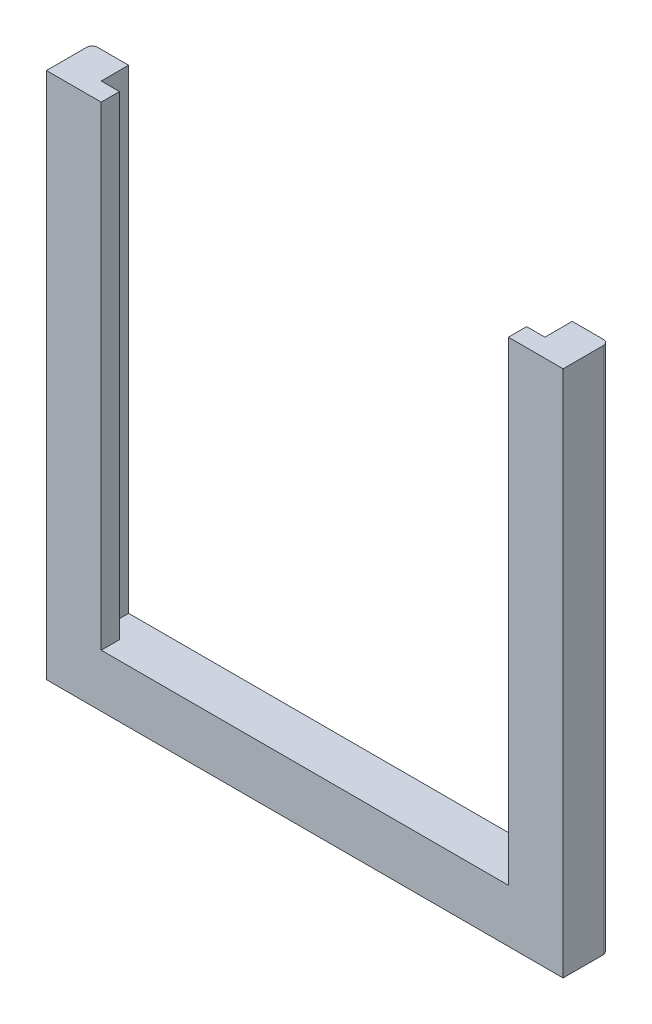
ISO-10303-21;
HEADER;
FILE_DESCRIPTION(('STEP AP214'),'2;1');
FILE_NAME('part.step','',(''),(''),'','','');
FILE_SCHEMA(('AUTOMOTIVE_DESIGN { 1 0 10303 214 1 1 1 1 }'));
ENDSEC;
DATA;
#1=APPLICATION_CONTEXT('core data for automotive mechanical design processes');
#2=APPLICATION_PROTOCOL_DEFINITION('international standard','automotive_design',2000,#1);
#3=PRODUCT_CONTEXT('',#1,'mechanical');
#4=PRODUCT('Part','Part','',(#3));
#5=PRODUCT_RELATED_PRODUCT_CATEGORY('part','',(#4));
#6=PRODUCT_DEFINITION_FORMATION('','',#4);
#7=PRODUCT_DEFINITION_CONTEXT('part definition',#1,'design');
#8=PRODUCT_DEFINITION('design','',#6,#7);
#9=PRODUCT_DEFINITION_SHAPE('','',#8);
#10=(LENGTH_UNIT() NAMED_UNIT(*) SI_UNIT(.MILLI.,.METRE.));
#11=(NAMED_UNIT(*) PLANE_ANGLE_UNIT() SI_UNIT($,.RADIAN.));
#12=(NAMED_UNIT(*) SI_UNIT($,.STERADIAN.) SOLID_ANGLE_UNIT());
#13=UNCERTAINTY_MEASURE_WITH_UNIT(LENGTH_MEASURE(1.E-05),#10,'distance_accuracy_value','');
#14=(GEOMETRIC_REPRESENTATION_CONTEXT(3) GLOBAL_UNCERTAINTY_ASSIGNED_CONTEXT((#13)) GLOBAL_UNIT_ASSIGNED_CONTEXT((#10,
#11,#12)) REPRESENTATION_CONTEXT('',''));
#15=CARTESIAN_POINT('',(0.,0.,0.));
#16=DIRECTION('',(0.,0.,1.));
#17=DIRECTION('',(1.,0.,0.));
#18=AXIS2_PLACEMENT_3D('',#15,#16,#17);
#19=CARTESIAN_POINT('',(2.,2.9,0.));
#20=DIRECTION('',(-1.,0.,0.));
#21=DIRECTION('',(0.,0.,1.));
#22=AXIS2_PLACEMENT_3D('',#19,#20,#21);
#23=PLANE('',#22);
#24=DIRECTION('',(0.,1.,0.));
#25=VECTOR('',#24,1.);
#26=CARTESIAN_POINT('',(2.,2.9,1.5));
#27=LINE('',#26,#25);
#28=CARTESIAN_POINT('',(2.,28.9,1.5));
#29=VERTEX_POINT('',#28);
#30=CARTESIAN_POINT('',(2.,2.9,1.5));
#31=VERTEX_POINT('',#30);
#32=EDGE_CURVE('E174',#29,#31,#27,.F.);
#33=ORIENTED_EDGE('',*,*,#32,.T.);
#34=DIRECTION('',(0.,0.,1.));
#35=VECTOR('',#34,1.);
#36=CARTESIAN_POINT('',(2.,2.9,0.));
#37=LINE('',#36,#35);
#38=CARTESIAN_POINT('',(2.,2.9,0.));
#39=VERTEX_POINT('',#38);
#40=EDGE_CURVE('E221',#39,#31,#37,.T.);
#41=ORIENTED_EDGE('',*,*,#40,.F.);
#42=DIRECTION('',(0.,1.,0.));
#43=VECTOR('',#42,1.);
#44=CARTESIAN_POINT('',(2.,0.,0.));
#45=LINE('',#44,#43);
#46=CARTESIAN_POINT('',(2.,28.9,0.));
#47=VERTEX_POINT('',#46);
#48=EDGE_CURVE('E165',#47,#39,#45,.F.);
#49=ORIENTED_EDGE('',*,*,#48,.F.);
#50=DIRECTION('',(0.,0.,1.));
#51=VECTOR('',#50,1.);
#52=CARTESIAN_POINT('',(2.,28.9,0.));
#53=LINE('',#52,#51);
#54=EDGE_CURVE('E154',#29,#47,#53,.F.);
#55=ORIENTED_EDGE('',*,*,#54,.F.);
#56=EDGE_LOOP('',(#33,#41,#49,#55));
#57=FACE_BOUND('',#56,.T.);
#58=ADVANCED_FACE('F17',(#57),#23,.F.);
#59=CARTESIAN_POINT('',(26.3,2.9,0.));
#60=DIRECTION('',(1.,0.,0.));
#61=DIRECTION('',(0.,0.,-1.));
#62=AXIS2_PLACEMENT_3D('',#59,#60,#61);
#63=PLANE('',#62);
#64=DIRECTION('',(0.,1.,0.));
#65=VECTOR('',#64,1.);
#66=CARTESIAN_POINT('',(26.3,0.,0.));
#67=LINE('',#66,#65);
#68=CARTESIAN_POINT('',(26.3,2.9,0.));
#69=VERTEX_POINT('',#68);
#70=CARTESIAN_POINT('',(26.3,28.9,0.));
#71=VERTEX_POINT('',#70);
#72=EDGE_CURVE('E123',#69,#71,#67,.T.);
#73=ORIENTED_EDGE('',*,*,#72,.F.);
#74=DIRECTION('',(0.,0.,-1.));
#75=VECTOR('',#74,1.);
#76=CARTESIAN_POINT('',(26.3,2.9,0.));
#77=LINE('',#76,#75);
#78=CARTESIAN_POINT('',(26.3,2.9,1.5));
#79=VERTEX_POINT('',#78);
#80=EDGE_CURVE('E150',#79,#69,#77,.T.);
#81=ORIENTED_EDGE('',*,*,#80,.F.);
#82=DIRECTION('',(0.,1.,0.));
#83=VECTOR('',#82,1.);
#84=CARTESIAN_POINT('',(26.3,2.9,1.5));
#85=LINE('',#84,#83);
#86=CARTESIAN_POINT('',(26.3,28.9,1.5));
#87=VERTEX_POINT('',#86);
#88=EDGE_CURVE('E160',#79,#87,#85,.T.);
#89=ORIENTED_EDGE('',*,*,#88,.T.);
#90=DIRECTION('',(0.,0.,-1.));
#91=VECTOR('',#90,1.);
#92=CARTESIAN_POINT('',(26.3,28.9,0.));
#93=LINE('',#92,#91);
#94=EDGE_CURVE('E134',#71,#87,#93,.F.);
#95=ORIENTED_EDGE('',*,*,#94,.F.);
#96=EDGE_LOOP('',(#73,#81,#89,#95));
#97=FACE_BOUND('',#96,.T.);
#98=ADVANCED_FACE('F304',(#97),#63,.F.);
#99=CARTESIAN_POINT('',(28.,0.,0.3));
#100=DIRECTION('',(0.,-1.,0.));
#101=DIRECTION('',(0.,0.,-1.));
#102=AXIS2_PLACEMENT_3D('',#99,#100,#101);
#103=CYLINDRICAL_SURFACE('',#102,0.3);
#104=CARTESIAN_POINT('',(28.,0.3,0.3));
#105=DIRECTION('',(-0.707106781186547,-0.707106781186547,0.));
#106=DIRECTION('',(-0.707106781186547,0.707106781186547,0.));
#107=AXIS2_PLACEMENT_3D('',#104,#105,#106);
#108=ELLIPSE('',#107,0.424264068711928,0.3);
#109=CARTESIAN_POINT('',(28.,0.3,0.));
#110=VERTEX_POINT('',#109);
#111=CARTESIAN_POINT('',(28.3,0.,0.3));
#112=VERTEX_POINT('',#111);
#113=EDGE_CURVE('E133',#110,#112,#108,.T.);
#114=ORIENTED_EDGE('',*,*,#113,.F.);
#115=DIRECTION('',(0.,1.,0.));
#116=VECTOR('',#115,1.);
#117=CARTESIAN_POINT('',(28.,0.,0.));
#118=LINE('',#117,#116);
#119=CARTESIAN_POINT('',(28.,28.9,0.));
#120=VERTEX_POINT('',#119);
#121=EDGE_CURVE('E119',#120,#110,#118,.F.);
#122=ORIENTED_EDGE('',*,*,#121,.F.);
#123=CARTESIAN_POINT('',(28.,28.9,0.3));
#124=DIRECTION('',(0.,-1.,0.));
#125=DIRECTION('',(0.,0.,-1.));
#126=AXIS2_PLACEMENT_3D('',#123,#124,#125);
#127=CIRCLE('',#126,0.3);
#128=CARTESIAN_POINT('',(28.3,28.9,0.3));
#129=VERTEX_POINT('',#128);
#130=EDGE_CURVE('E20',#120,#129,#127,.T.);
#131=ORIENTED_EDGE('',*,*,#130,.T.);
#132=DIRECTION('',(0.,1.,0.));
#133=VECTOR('',#132,1.);
#134=CARTESIAN_POINT('',(28.3,0.,0.3));
#135=LINE('',#134,#133);
#136=EDGE_CURVE('E159',#129,#112,#135,.F.);
#137=ORIENTED_EDGE('',*,*,#136,.T.);
#138=EDGE_LOOP('',(#114,#122,#131,#137));
#139=FACE_BOUND('',#138,.T.);
#140=ADVANCED_FACE('F135',(#139),#103,.T.);
#141=CARTESIAN_POINT('',(0.,0.3,0.3));
#142=DIRECTION('',(-1.,0.,0.));
#143=DIRECTION('',(0.,0.,1.));
#144=AXIS2_PLACEMENT_3D('',#141,#142,#143);
#145=CYLINDRICAL_SURFACE('',#144,0.3);
#146=ORIENTED_EDGE('',*,*,#113,.T.);
#147=DIRECTION('',(1.,0.,0.));
#148=VECTOR('',#147,1.);
#149=CARTESIAN_POINT('',(0.,0.,0.3));
#150=LINE('',#149,#148);
#151=CARTESIAN_POINT('',(0.,0.,0.3));
#152=VERTEX_POINT('',#151);
#153=EDGE_CURVE('E197',#112,#152,#150,.F.);
#154=ORIENTED_EDGE('',*,*,#153,.T.);
#155=CARTESIAN_POINT('',(0.3,0.3,0.3));
#156=DIRECTION('',(-0.707106781186547,0.707106781186547,0.));
#157=DIRECTION('',(0.707106781186547,0.707106781186547,0.));
#158=AXIS2_PLACEMENT_3D('',#155,#156,#157);
#159=ELLIPSE('',#158,0.424264068711928,0.3);
#160=CARTESIAN_POINT('',(0.3,0.3,0.));
#161=VERTEX_POINT('',#160);
#162=EDGE_CURVE('E177',#161,#152,#159,.T.);
#163=ORIENTED_EDGE('',*,*,#162,.F.);
#164=DIRECTION('',(-1.,0.,0.));
#165=VECTOR('',#164,1.);
#166=CARTESIAN_POINT('',(0.,0.3,0.));
#167=LINE('',#166,#165);
#168=EDGE_CURVE('E137',#110,#161,#167,.T.);
#169=ORIENTED_EDGE('',*,*,#168,.F.);
#170=EDGE_LOOP('',(#146,#154,#163,#169));
#171=FACE_BOUND('',#170,.T.);
#172=ADVANCED_FACE('F194',(#171),#145,.T.);
#173=CARTESIAN_POINT('',(0.3,0.,0.3));
#174=DIRECTION('',(0.,1.,0.));
#175=DIRECTION('',(0.,0.,1.));
#176=AXIS2_PLACEMENT_3D('',#173,#174,#175);
#177=CYLINDRICAL_SURFACE('',#176,0.3);
#178=ORIENTED_EDGE('',*,*,#162,.T.);
#179=DIRECTION('',(0.,1.,0.));
#180=VECTOR('',#179,1.);
#181=CARTESIAN_POINT('',(0.,0.,0.3));
#182=LINE('',#181,#180);
#183=CARTESIAN_POINT('',(0.,28.9,0.3));
#184=VERTEX_POINT('',#183);
#185=EDGE_CURVE('E251',#152,#184,#182,.T.);
#186=ORIENTED_EDGE('',*,*,#185,.T.);
#187=CARTESIAN_POINT('',(0.3,28.9,0.3));
#188=DIRECTION('',(0.,1.,0.));
#189=DIRECTION('',(0.,0.,1.));
#190=AXIS2_PLACEMENT_3D('',#187,#188,#189);
#191=CIRCLE('',#190,0.3);
#192=CARTESIAN_POINT('',(0.3,28.9,0.));
#193=VERTEX_POINT('',#192);
#194=EDGE_CURVE('E191',#184,#193,#191,.F.);
#195=ORIENTED_EDGE('',*,*,#194,.T.);
#196=DIRECTION('',(0.,1.,0.));
#197=VECTOR('',#196,1.);
#198=CARTESIAN_POINT('',(0.3,0.,0.));
#199=LINE('',#198,#197);
#200=EDGE_CURVE('E139',#161,#193,#199,.T.);
#201=ORIENTED_EDGE('',*,*,#200,.F.);
#202=EDGE_LOOP('',(#178,#186,#195,#201));
#203=FACE_BOUND('',#202,.T.);
#204=ADVANCED_FACE('F289',(#203),#177,.T.);
#205=CARTESIAN_POINT('',(3.,2.9,1.5));
#206=DIRECTION('',(0.,0.,1.));
#207=DIRECTION('',(1.,0.,0.));
#208=AXIS2_PLACEMENT_3D('',#205,#206,#207);
#209=PLANE('',#208);
#210=DIRECTION('',(0.,1.,0.));
#211=VECTOR('',#210,1.);
#212=CARTESIAN_POINT('',(3.,2.9,1.5));
#213=LINE('',#212,#211);
#214=CARTESIAN_POINT('',(3.,28.9,1.5));
#215=VERTEX_POINT('',#214);
#216=CARTESIAN_POINT('',(3.,2.9,1.5));
#217=VERTEX_POINT('',#216);
#218=EDGE_CURVE('E183',#215,#217,#213,.F.);
#219=ORIENTED_EDGE('',*,*,#218,.T.);
#220=DIRECTION('',(1.,0.,0.));
#221=VECTOR('',#220,1.);
#222=CARTESIAN_POINT('',(3.,2.9,1.5));
#223=LINE('',#222,#221);
#224=EDGE_CURVE('E146',#31,#217,#223,.T.);
#225=ORIENTED_EDGE('',*,*,#224,.F.);
#226=ORIENTED_EDGE('',*,*,#32,.F.);
#227=DIRECTION('',(1.,0.,0.));
#228=VECTOR('',#227,1.);
#229=CARTESIAN_POINT('',(0.,28.9,1.5));
#230=LINE('',#229,#228);
#231=EDGE_CURVE('E180',#29,#215,#230,.T.);
#232=ORIENTED_EDGE('',*,*,#231,.T.);
#233=EDGE_LOOP('',(#219,#225,#226,#232));
#234=FACE_BOUND('',#233,.T.);
#235=ADVANCED_FACE('F325',(#234),#209,.F.);
#236=CARTESIAN_POINT('',(0.,0.,0.));
#237=DIRECTION('',(0.,0.,-1.));
#238=DIRECTION('',(-1.,0.,0.));
#239=AXIS2_PLACEMENT_3D('',#236,#237,#238);
#240=PLANE('',#239);
#241=ORIENTED_EDGE('',*,*,#48,.T.);
#242=DIRECTION('',(1.,0.,0.));
#243=VECTOR('',#242,1.);
#244=CARTESIAN_POINT('',(0.,2.9,0.));
#245=LINE('',#244,#243);
#246=EDGE_CURVE('E227',#39,#69,#245,.T.);
#247=ORIENTED_EDGE('',*,*,#246,.T.);
#248=ORIENTED_EDGE('',*,*,#72,.T.);
#249=DIRECTION('',(-1.,0.,0.));
#250=VECTOR('',#249,1.);
#251=CARTESIAN_POINT('',(0.,28.9,0.));
#252=LINE('',#251,#250);
#253=EDGE_CURVE('E114',#71,#120,#252,.F.);
#254=ORIENTED_EDGE('',*,*,#253,.T.);
#255=ORIENTED_EDGE('',*,*,#121,.T.);
#256=ORIENTED_EDGE('',*,*,#168,.T.);
#257=ORIENTED_EDGE('',*,*,#200,.T.);
#258=DIRECTION('',(1.,0.,0.));
#259=VECTOR('',#258,1.);
#260=CARTESIAN_POINT('',(0.,28.9,0.));
#261=LINE('',#260,#259);
#262=EDGE_CURVE('E184',#193,#47,#261,.T.);
#263=ORIENTED_EDGE('',*,*,#262,.T.);
#264=EDGE_LOOP('',(#241,#247,#248,#254,#255,#256,#257,#263));
#265=FACE_BOUND('',#264,.T.);
#266=ADVANCED_FACE('F117',(#265),#240,.T.);
#267=CARTESIAN_POINT('',(26.3,2.9,1.5));
#268=DIRECTION('',(0.,0.,1.));
#269=DIRECTION('',(1.,0.,0.));
#270=AXIS2_PLACEMENT_3D('',#267,#268,#269);
#271=PLANE('',#270);
#272=ORIENTED_EDGE('',*,*,#88,.F.);
#273=DIRECTION('',(1.,0.,0.));
#274=VECTOR('',#273,1.);
#275=CARTESIAN_POINT('',(0.,2.9,1.5));
#276=LINE('',#275,#274);
#277=CARTESIAN_POINT('',(25.3,2.9,1.5));
#278=VERTEX_POINT('',#277);
#279=EDGE_CURVE('E168',#79,#278,#276,.F.);
#280=ORIENTED_EDGE('',*,*,#279,.T.);
#281=DIRECTION('',(0.,1.,0.));
#282=VECTOR('',#281,1.);
#283=CARTESIAN_POINT('',(25.3,2.9,1.5));
#284=LINE('',#283,#282);
#285=CARTESIAN_POINT('',(25.3,28.9,1.5));
#286=VERTEX_POINT('',#285);
#287=EDGE_CURVE('E232',#278,#286,#284,.T.);
#288=ORIENTED_EDGE('',*,*,#287,.T.);
#289=DIRECTION('',(1.,0.,0.));
#290=VECTOR('',#289,1.);
#291=CARTESIAN_POINT('',(26.3,28.9,1.5));
#292=LINE('',#291,#290);
#293=EDGE_CURVE('E157',#87,#286,#292,.F.);
#294=ORIENTED_EDGE('',*,*,#293,.F.);
#295=EDGE_LOOP('',(#272,#280,#288,#294));
#296=FACE_BOUND('',#295,.T.);
#297=ADVANCED_FACE('F308',(#296),#271,.F.);
#298=CARTESIAN_POINT('',(28.3,0.,2.50000000000001));
#299=DIRECTION('',(-1.,0.,0.));
#300=DIRECTION('',(0.,0.,1.));
#301=AXIS2_PLACEMENT_3D('',#298,#299,#300);
#302=PLANE('',#301);
#303=ORIENTED_EDGE('',*,*,#136,.F.);
#304=DIRECTION('',(0.,0.,-1.));
#305=VECTOR('',#304,1.);
#306=CARTESIAN_POINT('',(28.3,28.9,2.50000000000001));
#307=LINE('',#306,#305);
#308=CARTESIAN_POINT('',(28.3,28.9,2.50000000000001));
#309=VERTEX_POINT('',#308);
#310=EDGE_CURVE('E129',#129,#309,#307,.F.);
#311=ORIENTED_EDGE('',*,*,#310,.T.);
#312=DIRECTION('',(0.,1.,0.));
#313=VECTOR('',#312,1.);
#314=CARTESIAN_POINT('',(28.3,0.,2.50000000000001));
#315=LINE('',#314,#313);
#316=CARTESIAN_POINT('',(28.3,0.,2.50000000000001));
#317=VERTEX_POINT('',#316);
#318=EDGE_CURVE('E212',#309,#317,#315,.F.);
#319=ORIENTED_EDGE('',*,*,#318,.T.);
#320=DIRECTION('',(0.,0.,1.));
#321=VECTOR('',#320,1.);
#322=CARTESIAN_POINT('',(28.3,0.,2.50000000000001));
#323=LINE('',#322,#321);
#324=EDGE_CURVE('E201',#317,#112,#323,.F.);
#325=ORIENTED_EDGE('',*,*,#324,.T.);
#326=EDGE_LOOP('',(#303,#311,#319,#325));
#327=FACE_BOUND('',#326,.T.);
#328=ADVANCED_FACE('F211',(#327),#302,.F.);
#329=CARTESIAN_POINT('',(0.,0.,2.50000000000001));
#330=DIRECTION('',(0.,1.,0.));
#331=DIRECTION('',(0.,0.,1.));
#332=AXIS2_PLACEMENT_3D('',#329,#330,#331);
#333=PLANE('',#332);
#334=ORIENTED_EDGE('',*,*,#153,.F.);
#335=ORIENTED_EDGE('',*,*,#324,.F.);
#336=DIRECTION('',(-1.,0.,0.));
#337=VECTOR('',#336,1.);
#338=CARTESIAN_POINT('',(0.,0.,2.50000000000001));
#339=LINE('',#338,#337);
#340=CARTESIAN_POINT('',(0.,0.,2.50000000000001));
#341=VERTEX_POINT('',#340);
#342=EDGE_CURVE('E255',#317,#341,#339,.T.);
#343=ORIENTED_EDGE('',*,*,#342,.T.);
#344=DIRECTION('',(0.,0.,-1.));
#345=VECTOR('',#344,1.);
#346=CARTESIAN_POINT('',(0.,0.,2.50000000000001));
#347=LINE('',#346,#345);
#348=EDGE_CURVE('E208',#341,#152,#347,.T.);
#349=ORIENTED_EDGE('',*,*,#348,.T.);
#350=EDGE_LOOP('',(#334,#335,#343,#349));
#351=FACE_BOUND('',#350,.T.);
#352=ADVANCED_FACE('F205',(#351),#333,.F.);
#353=CARTESIAN_POINT('',(0.,0.,2.50000000000001));
#354=DIRECTION('',(1.,0.,0.));
#355=DIRECTION('',(0.,0.,-1.));
#356=AXIS2_PLACEMENT_3D('',#353,#354,#355);
#357=PLANE('',#356);
#358=ORIENTED_EDGE('',*,*,#185,.F.);
#359=ORIENTED_EDGE('',*,*,#348,.F.);
#360=DIRECTION('',(0.,1.,0.));
#361=VECTOR('',#360,1.);
#362=CARTESIAN_POINT('',(0.,0.,2.50000000000001));
#363=LINE('',#362,#361);
#364=CARTESIAN_POINT('',(0.,28.9,2.50000000000001));
#365=VERTEX_POINT('',#364);
#366=EDGE_CURVE('E271',#341,#365,#363,.T.);
#367=ORIENTED_EDGE('',*,*,#366,.T.);
#368=DIRECTION('',(0.,0.,-1.));
#369=VECTOR('',#368,1.);
#370=CARTESIAN_POINT('',(0.,28.9,2.50000000000001));
#371=LINE('',#370,#369);
#372=EDGE_CURVE('E246',#365,#184,#371,.T.);
#373=ORIENTED_EDGE('',*,*,#372,.T.);
#374=EDGE_LOOP('',(#358,#359,#367,#373));
#375=FACE_BOUND('',#374,.T.);
#376=ADVANCED_FACE('F287',(#375),#357,.F.);
#377=CARTESIAN_POINT('',(0.,28.9,2.50000000000001));
#378=DIRECTION('',(0.,-1.,0.));
#379=DIRECTION('',(0.,0.,-1.));
#380=AXIS2_PLACEMENT_3D('',#377,#378,#379);
#381=PLANE('',#380);
#382=DIRECTION('',(0.,0.,1.));
#383=VECTOR('',#382,1.);
#384=CARTESIAN_POINT('',(3.,28.9,2.50000000000001));
#385=LINE('',#384,#383);
#386=CARTESIAN_POINT('',(3.,28.9,2.50000000000001));
#387=VERTEX_POINT('',#386);
#388=EDGE_CURVE('E171',#387,#215,#385,.F.);
#389=ORIENTED_EDGE('',*,*,#388,.T.);
#390=ORIENTED_EDGE('',*,*,#231,.F.);
#391=ORIENTED_EDGE('',*,*,#54,.T.);
#392=ORIENTED_EDGE('',*,*,#262,.F.);
#393=ORIENTED_EDGE('',*,*,#194,.F.);
#394=ORIENTED_EDGE('',*,*,#372,.F.);
#395=DIRECTION('',(-1.,0.,0.));
#396=VECTOR('',#395,1.);
#397=CARTESIAN_POINT('',(0.,28.9,2.50000000000001));
#398=LINE('',#397,#396);
#399=EDGE_CURVE('E267',#365,#387,#398,.F.);
#400=ORIENTED_EDGE('',*,*,#399,.T.);
#401=EDGE_LOOP('',(#389,#390,#391,#392,#393,#394,#400));
#402=FACE_BOUND('',#401,.T.);
#403=ADVANCED_FACE('F293',(#402),#381,.F.);
#404=CARTESIAN_POINT('',(3.,2.9,2.50000000000001));
#405=DIRECTION('',(-1.,0.,0.));
#406=DIRECTION('',(0.,0.,1.));
#407=AXIS2_PLACEMENT_3D('',#404,#405,#406);
#408=PLANE('',#407);
#409=DIRECTION('',(0.,1.,0.));
#410=VECTOR('',#409,1.);
#411=CARTESIAN_POINT('',(3.,0.,2.50000000000001));
#412=LINE('',#411,#410);
#413=CARTESIAN_POINT('',(3.,2.9,2.50000000000001));
#414=VERTEX_POINT('',#413);
#415=EDGE_CURVE('E270',#387,#414,#412,.F.);
#416=ORIENTED_EDGE('',*,*,#415,.T.);
#417=DIRECTION('',(0.,0.,-1.));
#418=VECTOR('',#417,1.);
#419=CARTESIAN_POINT('',(3.,2.9,0.));
#420=LINE('',#419,#418);
#421=EDGE_CURVE('E170',#414,#217,#420,.T.);
#422=ORIENTED_EDGE('',*,*,#421,.T.);
#423=ORIENTED_EDGE('',*,*,#218,.F.);
#424=ORIENTED_EDGE('',*,*,#388,.F.);
#425=EDGE_LOOP('',(#416,#422,#423,#424));
#426=FACE_BOUND('',#425,.T.);
#427=ADVANCED_FACE('F323',(#426),#408,.F.);
#428=CARTESIAN_POINT('',(0.,2.9,0.));
#429=DIRECTION('',(0.,-1.,0.));
#430=DIRECTION('',(0.,0.,-1.));
#431=AXIS2_PLACEMENT_3D('',#428,#429,#430);
#432=PLANE('',#431);
#433=ORIENTED_EDGE('',*,*,#246,.F.);
#434=ORIENTED_EDGE('',*,*,#40,.T.);
#435=ORIENTED_EDGE('',*,*,#224,.T.);
#436=ORIENTED_EDGE('',*,*,#421,.F.);
#437=DIRECTION('',(-1.,0.,0.));
#438=VECTOR('',#437,1.);
#439=CARTESIAN_POINT('',(0.,2.9,2.50000000000001));
#440=LINE('',#439,#438);
#441=CARTESIAN_POINT('',(25.3,2.9,2.50000000000001));
#442=VERTEX_POINT('',#441);
#443=EDGE_CURVE('E319',#414,#442,#440,.F.);
#444=ORIENTED_EDGE('',*,*,#443,.T.);
#445=DIRECTION('',(0.,0.,-1.));
#446=VECTOR('',#445,1.);
#447=CARTESIAN_POINT('',(25.3,2.9,1.5));
#448=LINE('',#447,#446);
#449=EDGE_CURVE('E228',#442,#278,#448,.T.);
#450=ORIENTED_EDGE('',*,*,#449,.T.);
#451=ORIENTED_EDGE('',*,*,#279,.F.);
#452=ORIENTED_EDGE('',*,*,#80,.T.);
#453=EDGE_LOOP('',(#433,#434,#435,#436,#444,#450,#451,#452));
#454=FACE_BOUND('',#453,.T.);
#455=ADVANCED_FACE('F299',(#454),#432,.F.);
#456=CARTESIAN_POINT('',(25.3,2.9,1.5));
#457=DIRECTION('',(1.,0.,0.));
#458=DIRECTION('',(0.,0.,-1.));
#459=AXIS2_PLACEMENT_3D('',#456,#457,#458);
#460=PLANE('',#459);
#461=ORIENTED_EDGE('',*,*,#287,.F.);
#462=ORIENTED_EDGE('',*,*,#449,.F.);
#463=DIRECTION('',(0.,1.,0.));
#464=VECTOR('',#463,1.);
#465=CARTESIAN_POINT('',(25.3,0.,2.50000000000001));
#466=LINE('',#465,#464);
#467=CARTESIAN_POINT('',(25.3,28.9,2.50000000000001));
#468=VERTEX_POINT('',#467);
#469=EDGE_CURVE('E26',#442,#468,#466,.T.);
#470=ORIENTED_EDGE('',*,*,#469,.T.);
#471=DIRECTION('',(0.,0.,-1.));
#472=VECTOR('',#471,1.);
#473=CARTESIAN_POINT('',(25.3,28.9,2.50000000000001));
#474=LINE('',#473,#472);
#475=EDGE_CURVE('E34',#468,#286,#474,.T.);
#476=ORIENTED_EDGE('',*,*,#475,.T.);
#477=EDGE_LOOP('',(#461,#462,#470,#476));
#478=FACE_BOUND('',#477,.T.);
#479=ADVANCED_FACE('F312',(#478),#460,.F.);
#480=CARTESIAN_POINT('',(0.,28.9,2.50000000000001));
#481=DIRECTION('',(0.,-1.,0.));
#482=DIRECTION('',(0.,0.,-1.));
#483=AXIS2_PLACEMENT_3D('',#480,#481,#482);
#484=PLANE('',#483);
#485=ORIENTED_EDGE('',*,*,#94,.T.);
#486=ORIENTED_EDGE('',*,*,#293,.T.);
#487=ORIENTED_EDGE('',*,*,#475,.F.);
#488=DIRECTION('',(-1.,0.,0.));
#489=VECTOR('',#488,1.);
#490=CARTESIAN_POINT('',(0.,28.9,2.50000000000001));
#491=LINE('',#490,#489);
#492=EDGE_CURVE('E11',#468,#309,#491,.F.);
#493=ORIENTED_EDGE('',*,*,#492,.T.);
#494=ORIENTED_EDGE('',*,*,#310,.F.);
#495=ORIENTED_EDGE('',*,*,#130,.F.);
#496=ORIENTED_EDGE('',*,*,#253,.F.);
#497=EDGE_LOOP('',(#485,#486,#487,#493,#494,#495,#496));
#498=FACE_BOUND('',#497,.T.);
#499=ADVANCED_FACE('F127',(#498),#484,.F.);
#500=CARTESIAN_POINT('',(0.,0.,2.50000000000001));
#501=DIRECTION('',(0.,0.,-1.));
#502=DIRECTION('',(-1.,0.,0.));
#503=AXIS2_PLACEMENT_3D('',#500,#501,#502);
#504=PLANE('',#503);
#505=ORIENTED_EDGE('',*,*,#469,.F.);
#506=ORIENTED_EDGE('',*,*,#443,.F.);
#507=ORIENTED_EDGE('',*,*,#415,.F.);
#508=ORIENTED_EDGE('',*,*,#399,.F.);
#509=ORIENTED_EDGE('',*,*,#366,.F.);
#510=ORIENTED_EDGE('',*,*,#342,.F.);
#511=ORIENTED_EDGE('',*,*,#318,.F.);
#512=ORIENTED_EDGE('',*,*,#492,.F.);
#513=EDGE_LOOP('',(#505,#506,#507,#508,#509,#510,#511,#512));
#514=FACE_BOUND('',#513,.T.);
#515=ADVANCED_FACE('F283',(#514),#504,.F.);
#516=CLOSED_SHELL('',(#58,#98,#140,#172,#204,#235,#266,#297,#328,#352,#376,#403,#427,#455,#479,
#499,#515));
#517=MANIFOLD_SOLID_BREP('B1',#516);
#518=ADVANCED_BREP_SHAPE_REPRESENTATION('',(#18,#517),#14);
#519=SHAPE_DEFINITION_REPRESENTATION(#9,#518);
ENDSEC;
END-ISO-10303-21;
